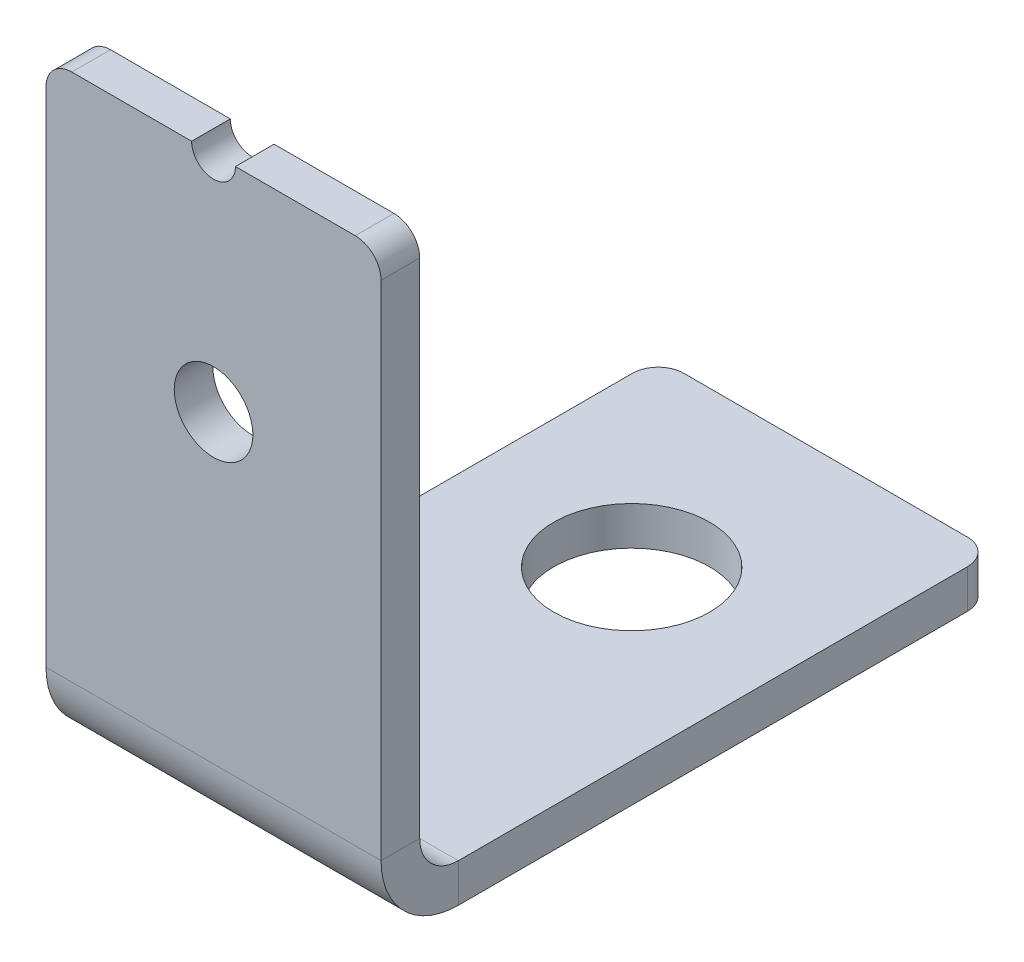
ISO-10303-21;
HEADER;
FILE_DESCRIPTION(('STEP AP214'),'2;1');
FILE_NAME('part.step','',(''),(''),'','','');
FILE_SCHEMA(('AUTOMOTIVE_DESIGN { 1 0 10303 214 1 1 1 1 }'));
ENDSEC;
DATA;
#1=APPLICATION_CONTEXT('core data for automotive mechanical design processes');
#2=APPLICATION_PROTOCOL_DEFINITION('international standard','automotive_design',2000,#1);
#3=PRODUCT_CONTEXT('',#1,'mechanical');
#4=PRODUCT('Part','Part','',(#3));
#5=PRODUCT_RELATED_PRODUCT_CATEGORY('part','',(#4));
#6=PRODUCT_DEFINITION_FORMATION('','',#4);
#7=PRODUCT_DEFINITION_CONTEXT('part definition',#1,'design');
#8=PRODUCT_DEFINITION('design','',#6,#7);
#9=PRODUCT_DEFINITION_SHAPE('','',#8);
#10=(LENGTH_UNIT() NAMED_UNIT(*) SI_UNIT(.MILLI.,.METRE.));
#11=(NAMED_UNIT(*) PLANE_ANGLE_UNIT() SI_UNIT($,.RADIAN.));
#12=(NAMED_UNIT(*) SI_UNIT($,.STERADIAN.) SOLID_ANGLE_UNIT());
#13=UNCERTAINTY_MEASURE_WITH_UNIT(LENGTH_MEASURE(1.E-05),#10,'distance_accuracy_value','');
#14=(GEOMETRIC_REPRESENTATION_CONTEXT(3) GLOBAL_UNCERTAINTY_ASSIGNED_CONTEXT((#13)) GLOBAL_UNIT_ASSIGNED_CONTEXT((#10,
#11,#12)) REPRESENTATION_CONTEXT('',''));
#15=CARTESIAN_POINT('',(0.,0.,0.));
#16=DIRECTION('',(0.,0.,1.));
#17=DIRECTION('',(1.,0.,0.));
#18=AXIS2_PLACEMENT_3D('',#15,#16,#17);
#19=CARTESIAN_POINT('',(0.,-3.,0.));
#20=DIRECTION('',(1.,0.,0.));
#21=DIRECTION('',(0.,0.,-1.));
#22=AXIS2_PLACEMENT_3D('',#19,#20,#21);
#23=PLANE('',#22);
#24=DIRECTION('',(0.,-1.,0.));
#25=VECTOR('',#24,1.);
#26=CARTESIAN_POINT('',(0.,-3.,-3.));
#27=LINE('',#26,#25);
#28=CARTESIAN_POINT('',(0.,0.,-3.));
#29=VERTEX_POINT('',#28);
#30=CARTESIAN_POINT('',(0.,-3.,-3.));
#31=VERTEX_POINT('',#30);
#32=EDGE_CURVE('E10',#29,#31,#27,.T.);
#33=ORIENTED_EDGE('',*,*,#32,.F.);
#34=DIRECTION('',(0.,0.,1.));
#35=VECTOR('',#34,1.);
#36=CARTESIAN_POINT('',(0.,0.,0.));
#37=LINE('',#36,#35);
#38=CARTESIAN_POINT('',(0.,0.,-42.5));
#39=VERTEX_POINT('',#38);
#40=EDGE_CURVE('E83',#29,#39,#37,.F.);
#41=ORIENTED_EDGE('',*,*,#40,.T.);
#42=DIRECTION('',(0.,-1.,0.));
#43=VECTOR('',#42,1.);
#44=CARTESIAN_POINT('',(0.,-3.,-42.5));
#45=LINE('',#44,#43);
#46=CARTESIAN_POINT('',(0.,-3.,-42.5));
#47=VERTEX_POINT('',#46);
#48=EDGE_CURVE('E26',#39,#47,#45,.T.);
#49=ORIENTED_EDGE('',*,*,#48,.T.);
#50=DIRECTION('',(0.,0.,-1.));
#51=VECTOR('',#50,1.);
#52=CARTESIAN_POINT('',(0.,-3.,0.));
#53=LINE('',#52,#51);
#54=EDGE_CURVE('E86',#31,#47,#53,.T.);
#55=ORIENTED_EDGE('',*,*,#54,.F.);
#56=EDGE_LOOP('',(#33,#41,#49,#55));
#57=FACE_BOUND('',#56,.T.);
#58=ADVANCED_FACE('F16',(#57),#23,.F.);
#59=CARTESIAN_POINT('',(2.,-3.,-42.5));
#60=DIRECTION('',(0.,1.,0.));
#61=DIRECTION('',(0.,0.,1.));
#62=AXIS2_PLACEMENT_3D('',#59,#60,#61);
#63=CYLINDRICAL_SURFACE('',#62,2.);
#64=ORIENTED_EDGE('',*,*,#48,.F.);
#65=CARTESIAN_POINT('',(2.,0.,-42.5));
#66=DIRECTION('',(0.,1.,0.));
#67=DIRECTION('',(0.,0.,1.));
#68=AXIS2_PLACEMENT_3D('',#65,#66,#67);
#69=CIRCLE('',#68,2.);
#70=CARTESIAN_POINT('',(2.00000000000001,0.,-44.5));
#71=VERTEX_POINT('',#70);
#72=EDGE_CURVE('E111',#39,#71,#69,.F.);
#73=ORIENTED_EDGE('',*,*,#72,.T.);
#74=DIRECTION('',(0.,-1.,0.));
#75=VECTOR('',#74,1.);
#76=CARTESIAN_POINT('',(2.00000000000001,-3.,-44.5));
#77=LINE('',#76,#75);
#78=CARTESIAN_POINT('',(2.00000000000001,-3.,-44.5));
#79=VERTEX_POINT('',#78);
#80=EDGE_CURVE('E151',#71,#79,#77,.T.);
#81=ORIENTED_EDGE('',*,*,#80,.T.);
#82=CARTESIAN_POINT('',(2.,-3.,-42.5));
#83=DIRECTION('',(0.,1.,0.));
#84=DIRECTION('',(0.,0.,1.));
#85=AXIS2_PLACEMENT_3D('',#82,#83,#84);
#86=CIRCLE('',#85,2.);
#87=EDGE_CURVE('E164',#47,#79,#86,.F.);
#88=ORIENTED_EDGE('',*,*,#87,.F.);
#89=EDGE_LOOP('',(#64,#73,#81,#88));
#90=FACE_BOUND('',#89,.T.);
#91=ADVANCED_FACE('F170',(#90),#63,.T.);
#92=CARTESIAN_POINT('',(26.,-3.,-44.5));
#93=DIRECTION('',(0.,0.,-1.));
#94=DIRECTION('',(-1.,0.,0.));
#95=AXIS2_PLACEMENT_3D('',#92,#93,#94);
#96=PLANE('',#95);
#97=ORIENTED_EDGE('',*,*,#80,.F.);
#98=DIRECTION('',(1.,0.,0.));
#99=VECTOR('',#98,1.);
#100=CARTESIAN_POINT('',(26.,0.,-44.5));
#101=LINE('',#100,#99);
#102=CARTESIAN_POINT('',(24.,0.,-44.5));
#103=VERTEX_POINT('',#102);
#104=EDGE_CURVE('E241',#103,#71,#101,.F.);
#105=ORIENTED_EDGE('',*,*,#104,.F.);
#106=DIRECTION('',(0.,-1.,0.));
#107=VECTOR('',#106,1.);
#108=CARTESIAN_POINT('',(24.,-3.,-44.5));
#109=LINE('',#108,#107);
#110=CARTESIAN_POINT('',(24.,-3.,-44.5));
#111=VERTEX_POINT('',#110);
#112=EDGE_CURVE('E148',#103,#111,#109,.T.);
#113=ORIENTED_EDGE('',*,*,#112,.T.);
#114=DIRECTION('',(-1.,0.,0.));
#115=VECTOR('',#114,1.);
#116=CARTESIAN_POINT('',(26.,-3.,-44.5));
#117=LINE('',#116,#115);
#118=EDGE_CURVE('E171',#111,#79,#117,.T.);
#119=ORIENTED_EDGE('',*,*,#118,.T.);
#120=EDGE_LOOP('',(#97,#105,#113,#119));
#121=FACE_BOUND('',#120,.T.);
#122=ADVANCED_FACE('F245',(#121),#96,.T.);
#123=CARTESIAN_POINT('',(24.,-3.,-42.5));
#124=DIRECTION('',(0.,1.,0.));
#125=DIRECTION('',(0.,0.,1.));
#126=AXIS2_PLACEMENT_3D('',#123,#124,#125);
#127=CYLINDRICAL_SURFACE('',#126,2.);
#128=ORIENTED_EDGE('',*,*,#112,.F.);
#129=CARTESIAN_POINT('',(24.,0.,-42.5));
#130=DIRECTION('',(0.,1.,0.));
#131=DIRECTION('',(0.,0.,1.));
#132=AXIS2_PLACEMENT_3D('',#129,#130,#131);
#133=CIRCLE('',#132,2.);
#134=CARTESIAN_POINT('',(26.,0.,-42.5));
#135=VERTEX_POINT('',#134);
#136=EDGE_CURVE('E238',#103,#135,#133,.F.);
#137=ORIENTED_EDGE('',*,*,#136,.T.);
#138=DIRECTION('',(0.,-1.,0.));
#139=VECTOR('',#138,1.);
#140=CARTESIAN_POINT('',(26.,-3.,-42.5));
#141=LINE('',#140,#139);
#142=CARTESIAN_POINT('',(26.,-3.,-42.5));
#143=VERTEX_POINT('',#142);
#144=EDGE_CURVE('E145',#135,#143,#141,.T.);
#145=ORIENTED_EDGE('',*,*,#144,.T.);
#146=CARTESIAN_POINT('',(24.,-3.,-42.5));
#147=DIRECTION('',(0.,1.,0.));
#148=DIRECTION('',(0.,0.,1.));
#149=AXIS2_PLACEMENT_3D('',#146,#147,#148);
#150=CIRCLE('',#149,2.);
#151=EDGE_CURVE('E173',#111,#143,#150,.F.);
#152=ORIENTED_EDGE('',*,*,#151,.F.);
#153=EDGE_LOOP('',(#128,#137,#145,#152));
#154=FACE_BOUND('',#153,.T.);
#155=ADVANCED_FACE('F252',(#154),#127,.T.);
#156=CARTESIAN_POINT('',(26.,-3.,0.));
#157=DIRECTION('',(1.,0.,0.));
#158=DIRECTION('',(0.,0.,-1.));
#159=AXIS2_PLACEMENT_3D('',#156,#157,#158);
#160=PLANE('',#159);
#161=ORIENTED_EDGE('',*,*,#144,.F.);
#162=DIRECTION('',(0.,0.,1.));
#163=VECTOR('',#162,1.);
#164=CARTESIAN_POINT('',(26.,0.,0.));
#165=LINE('',#164,#163);
#166=CARTESIAN_POINT('',(26.,0.,-3.));
#167=VERTEX_POINT('',#166);
#168=EDGE_CURVE('E218',#167,#135,#165,.F.);
#169=ORIENTED_EDGE('',*,*,#168,.F.);
#170=DIRECTION('',(0.,-1.,0.));
#171=VECTOR('',#170,1.);
#172=CARTESIAN_POINT('',(26.,-3.,-3.));
#173=LINE('',#172,#171);
#174=CARTESIAN_POINT('',(26.,-3.,-3.));
#175=VERTEX_POINT('',#174);
#176=EDGE_CURVE('E142',#167,#175,#173,.T.);
#177=ORIENTED_EDGE('',*,*,#176,.T.);
#178=DIRECTION('',(0.,0.,-1.));
#179=VECTOR('',#178,1.);
#180=CARTESIAN_POINT('',(26.,-3.,0.));
#181=LINE('',#180,#179);
#182=EDGE_CURVE('E179',#175,#143,#181,.T.);
#183=ORIENTED_EDGE('',*,*,#182,.T.);
#184=EDGE_LOOP('',(#161,#169,#177,#183));
#185=FACE_BOUND('',#184,.T.);
#186=ADVANCED_FACE('F256',(#185),#160,.T.);
#187=CARTESIAN_POINT('',(26.,3.,-3.));
#188=DIRECTION('',(1.,0.,0.));
#189=DIRECTION('',(0.,0.,-1.));
#190=AXIS2_PLACEMENT_3D('',#187,#188,#189);
#191=PLANE('',#190);
#192=ORIENTED_EDGE('',*,*,#176,.F.);
#193=CARTESIAN_POINT('',(26.,3.,-3.));
#194=DIRECTION('',(-1.,0.,0.));
#195=DIRECTION('',(0.,0.,1.));
#196=AXIS2_PLACEMENT_3D('',#193,#194,#195);
#197=CIRCLE('',#196,3.);
#198=CARTESIAN_POINT('',(26.,3.,0.));
#199=VERTEX_POINT('',#198);
#200=EDGE_CURVE('E100',#167,#199,#197,.T.);
#201=ORIENTED_EDGE('',*,*,#200,.T.);
#202=DIRECTION('',(0.,0.,1.));
#203=VECTOR('',#202,1.);
#204=CARTESIAN_POINT('',(26.,3.,3.));
#205=LINE('',#204,#203);
#206=CARTESIAN_POINT('',(26.,3.,3.));
#207=VERTEX_POINT('',#206);
#208=EDGE_CURVE('E140',#199,#207,#205,.T.);
#209=ORIENTED_EDGE('',*,*,#208,.T.);
#210=CARTESIAN_POINT('',(26.,3.,-3.));
#211=DIRECTION('',(-1.,0.,0.));
#212=DIRECTION('',(0.,0.,1.));
#213=AXIS2_PLACEMENT_3D('',#210,#211,#212);
#214=CIRCLE('',#213,6.);
#215=EDGE_CURVE('E210',#175,#207,#214,.T.);
#216=ORIENTED_EDGE('',*,*,#215,.F.);
#217=EDGE_LOOP('',(#192,#201,#209,#216));
#218=FACE_BOUND('',#217,.T.);
#219=ADVANCED_FACE('F259',(#218),#191,.T.);
#220=CARTESIAN_POINT('',(26.,0.,3.));
#221=DIRECTION('',(-1.,0.,0.));
#222=DIRECTION('',(0.,1.,0.));
#223=AXIS2_PLACEMENT_3D('',#220,#221,#222);
#224=PLANE('',#223);
#225=ORIENTED_EDGE('',*,*,#208,.F.);
#226=DIRECTION('',(0.,1.,0.));
#227=VECTOR('',#226,1.);
#228=CARTESIAN_POINT('',(26.,0.,0.));
#229=LINE('',#228,#227);
#230=CARTESIAN_POINT('',(26.,42.,0.));
#231=VERTEX_POINT('',#230);
#232=EDGE_CURVE('E217',#231,#199,#229,.F.);
#233=ORIENTED_EDGE('',*,*,#232,.F.);
#234=DIRECTION('',(0.,0.,1.));
#235=VECTOR('',#234,1.);
#236=CARTESIAN_POINT('',(26.,42.,3.));
#237=LINE('',#236,#235);
#238=CARTESIAN_POINT('',(26.,42.,3.));
#239=VERTEX_POINT('',#238);
#240=EDGE_CURVE('E137',#231,#239,#237,.T.);
#241=ORIENTED_EDGE('',*,*,#240,.T.);
#242=DIRECTION('',(0.,1.,0.));
#243=VECTOR('',#242,1.);
#244=CARTESIAN_POINT('',(26.,0.,3.));
#245=LINE('',#244,#243);
#246=EDGE_CURVE('E185',#239,#207,#245,.F.);
#247=ORIENTED_EDGE('',*,*,#246,.T.);
#248=EDGE_LOOP('',(#225,#233,#241,#247));
#249=FACE_BOUND('',#248,.T.);
#250=ADVANCED_FACE('F284',(#249),#224,.F.);
#251=CARTESIAN_POINT('',(24.,42.,3.));
#252=DIRECTION('',(0.,0.,-1.));
#253=DIRECTION('',(-1.,0.,0.));
#254=AXIS2_PLACEMENT_3D('',#251,#252,#253);
#255=CYLINDRICAL_SURFACE('',#254,2.);
#256=ORIENTED_EDGE('',*,*,#240,.F.);
#257=CARTESIAN_POINT('',(24.,42.,0.));
#258=DIRECTION('',(0.,0.,-1.));
#259=DIRECTION('',(-1.,0.,0.));
#260=AXIS2_PLACEMENT_3D('',#257,#258,#259);
#261=CIRCLE('',#260,2.);
#262=CARTESIAN_POINT('',(24.,44.,0.));
#263=VERTEX_POINT('',#262);
#264=EDGE_CURVE('E232',#231,#263,#261,.F.);
#265=ORIENTED_EDGE('',*,*,#264,.T.);
#266=DIRECTION('',(0.,0.,1.));
#267=VECTOR('',#266,1.);
#268=CARTESIAN_POINT('',(24.,44.,3.));
#269=LINE('',#268,#267);
#270=CARTESIAN_POINT('',(24.,44.,3.));
#271=VERTEX_POINT('',#270);
#272=EDGE_CURVE('E134',#263,#271,#269,.T.);
#273=ORIENTED_EDGE('',*,*,#272,.T.);
#274=CARTESIAN_POINT('',(24.,42.,3.));
#275=DIRECTION('',(0.,0.,-1.));
#276=DIRECTION('',(-1.,0.,0.));
#277=AXIS2_PLACEMENT_3D('',#274,#275,#276);
#278=CIRCLE('',#277,2.);
#279=EDGE_CURVE('E188',#239,#271,#278,.F.);
#280=ORIENTED_EDGE('',*,*,#279,.F.);
#281=EDGE_LOOP('',(#256,#265,#273,#280));
#282=FACE_BOUND('',#281,.T.);
#283=ADVANCED_FACE('F289',(#282),#255,.T.);
#284=CARTESIAN_POINT('',(26.,44.,3.));
#285=DIRECTION('',(0.,-1.,0.));
#286=DIRECTION('',(-1.,0.,0.));
#287=AXIS2_PLACEMENT_3D('',#284,#285,#286);
#288=PLANE('',#287);
#289=ORIENTED_EDGE('',*,*,#272,.F.);
#290=DIRECTION('',(-1.,0.,0.));
#291=VECTOR('',#290,1.);
#292=CARTESIAN_POINT('',(26.,44.,0.));
#293=LINE('',#292,#291);
#294=CARTESIAN_POINT('',(14.7,44.,0.));
#295=VERTEX_POINT('',#294);
#296=EDGE_CURVE('E229',#263,#295,#293,.T.);
#297=ORIENTED_EDGE('',*,*,#296,.T.);
#298=DIRECTION('',(0.,0.,1.));
#299=VECTOR('',#298,1.);
#300=CARTESIAN_POINT('',(14.7,44.,3.));
#301=LINE('',#300,#299);
#302=CARTESIAN_POINT('',(14.7,44.,3.));
#303=VERTEX_POINT('',#302);
#304=EDGE_CURVE('E131',#295,#303,#301,.T.);
#305=ORIENTED_EDGE('',*,*,#304,.T.);
#306=DIRECTION('',(-1.,0.,0.));
#307=VECTOR('',#306,1.);
#308=CARTESIAN_POINT('',(26.,44.,3.));
#309=LINE('',#308,#307);
#310=EDGE_CURVE('E191',#271,#303,#309,.T.);
#311=ORIENTED_EDGE('',*,*,#310,.F.);
#312=EDGE_LOOP('',(#289,#297,#305,#311));
#313=FACE_BOUND('',#312,.T.);
#314=ADVANCED_FACE('F292',(#313),#288,.F.);
#315=CARTESIAN_POINT('',(13.,44.,3.));
#316=DIRECTION('',(0.,0.,-1.));
#317=DIRECTION('',(-1.,0.,0.));
#318=AXIS2_PLACEMENT_3D('',#315,#316,#317);
#319=CYLINDRICAL_SURFACE('',#318,1.7);
#320=ORIENTED_EDGE('',*,*,#304,.F.);
#321=CARTESIAN_POINT('',(13.,44.,0.));
#322=DIRECTION('',(0.,0.,-1.));
#323=DIRECTION('',(-1.,0.,0.));
#324=AXIS2_PLACEMENT_3D('',#321,#322,#323);
#325=CIRCLE('',#324,1.7);
#326=CARTESIAN_POINT('',(11.3,44.,0.));
#327=VERTEX_POINT('',#326);
#328=EDGE_CURVE('E226',#295,#327,#325,.T.);
#329=ORIENTED_EDGE('',*,*,#328,.T.);
#330=DIRECTION('',(0.,0.,1.));
#331=VECTOR('',#330,1.);
#332=CARTESIAN_POINT('',(11.3,44.,3.));
#333=LINE('',#332,#331);
#334=CARTESIAN_POINT('',(11.3,44.,3.));
#335=VERTEX_POINT('',#334);
#336=EDGE_CURVE('E128',#327,#335,#333,.T.);
#337=ORIENTED_EDGE('',*,*,#336,.T.);
#338=CARTESIAN_POINT('',(13.,44.,3.));
#339=DIRECTION('',(0.,0.,-1.));
#340=DIRECTION('',(-1.,0.,0.));
#341=AXIS2_PLACEMENT_3D('',#338,#339,#340);
#342=CIRCLE('',#341,1.7);
#343=EDGE_CURVE('E194',#303,#335,#342,.T.);
#344=ORIENTED_EDGE('',*,*,#343,.F.);
#345=EDGE_LOOP('',(#320,#329,#337,#344));
#346=FACE_BOUND('',#345,.T.);
#347=ADVANCED_FACE('F300',(#346),#319,.F.);
#348=ORIENTED_EDGE('',*,*,#336,.F.);
#349=DIRECTION('',(-1.,0.,0.));
#350=VECTOR('',#349,1.);
#351=CARTESIAN_POINT('',(26.,44.,0.));
#352=LINE('',#351,#350);
#353=CARTESIAN_POINT('',(2.00000000000001,44.,0.));
#354=VERTEX_POINT('',#353);
#355=EDGE_CURVE('E223',#327,#354,#352,.T.);
#356=ORIENTED_EDGE('',*,*,#355,.T.);
#357=DIRECTION('',(0.,0.,1.));
#358=VECTOR('',#357,1.);
#359=CARTESIAN_POINT('',(2.00000000000001,44.,3.));
#360=LINE('',#359,#358);
#361=CARTESIAN_POINT('',(2.00000000000001,44.,3.));
#362=VERTEX_POINT('',#361);
#363=EDGE_CURVE('E125',#354,#362,#360,.T.);
#364=ORIENTED_EDGE('',*,*,#363,.T.);
#365=EDGE_CURVE('E195',#335,#362,#309,.T.);
#366=ORIENTED_EDGE('',*,*,#365,.F.);
#367=EDGE_LOOP('',(#348,#356,#364,#366));
#368=FACE_BOUND('',#367,.T.);
#369=ADVANCED_FACE('F304',(#368),#288,.F.);
#370=CARTESIAN_POINT('',(2.,42.,3.));
#371=DIRECTION('',(0.,0.,-1.));
#372=DIRECTION('',(-1.,0.,0.));
#373=AXIS2_PLACEMENT_3D('',#370,#371,#372);
#374=CYLINDRICAL_SURFACE('',#373,2.);
#375=ORIENTED_EDGE('',*,*,#363,.F.);
#376=CARTESIAN_POINT('',(2.,42.,0.));
#377=DIRECTION('',(0.,0.,-1.));
#378=DIRECTION('',(-1.,0.,0.));
#379=AXIS2_PLACEMENT_3D('',#376,#377,#378);
#380=CIRCLE('',#379,2.);
#381=CARTESIAN_POINT('',(0.,42.,0.));
#382=VERTEX_POINT('',#381);
#383=EDGE_CURVE('E220',#354,#382,#380,.F.);
#384=ORIENTED_EDGE('',*,*,#383,.T.);
#385=DIRECTION('',(0.,0.,1.));
#386=VECTOR('',#385,1.);
#387=CARTESIAN_POINT('',(0.,42.,3.));
#388=LINE('',#387,#386);
#389=CARTESIAN_POINT('',(0.,42.,3.));
#390=VERTEX_POINT('',#389);
#391=EDGE_CURVE('E122',#382,#390,#388,.T.);
#392=ORIENTED_EDGE('',*,*,#391,.T.);
#393=CARTESIAN_POINT('',(2.,42.,3.));
#394=DIRECTION('',(0.,0.,-1.));
#395=DIRECTION('',(-1.,0.,0.));
#396=AXIS2_PLACEMENT_3D('',#393,#394,#395);
#397=CIRCLE('',#396,2.);
#398=EDGE_CURVE('E198',#362,#390,#397,.F.);
#399=ORIENTED_EDGE('',*,*,#398,.F.);
#400=EDGE_LOOP('',(#375,#384,#392,#399));
#401=FACE_BOUND('',#400,.T.);
#402=ADVANCED_FACE('F305',(#401),#374,.T.);
#403=CARTESIAN_POINT('',(0.,0.,3.));
#404=DIRECTION('',(-1.,0.,0.));
#405=DIRECTION('',(0.,1.,0.));
#406=AXIS2_PLACEMENT_3D('',#403,#404,#405);
#407=PLANE('',#406);
#408=ORIENTED_EDGE('',*,*,#391,.F.);
#409=DIRECTION('',(0.,1.,0.));
#410=VECTOR('',#409,1.);
#411=CARTESIAN_POINT('',(0.,0.,0.));
#412=LINE('',#411,#410);
#413=CARTESIAN_POINT('',(0.,3.,0.));
#414=VERTEX_POINT('',#413);
#415=EDGE_CURVE('E105',#382,#414,#412,.F.);
#416=ORIENTED_EDGE('',*,*,#415,.T.);
#417=DIRECTION('',(0.,0.,1.));
#418=VECTOR('',#417,1.);
#419=CARTESIAN_POINT('',(0.,3.,3.));
#420=LINE('',#419,#418);
#421=CARTESIAN_POINT('',(0.,3.,3.));
#422=VERTEX_POINT('',#421);
#423=EDGE_CURVE('E20',#414,#422,#420,.T.);
#424=ORIENTED_EDGE('',*,*,#423,.T.);
#425=DIRECTION('',(0.,1.,0.));
#426=VECTOR('',#425,1.);
#427=CARTESIAN_POINT('',(0.,0.,3.));
#428=LINE('',#427,#426);
#429=EDGE_CURVE('E201',#390,#422,#428,.F.);
#430=ORIENTED_EDGE('',*,*,#429,.F.);
#431=EDGE_LOOP('',(#408,#416,#424,#430));
#432=FACE_BOUND('',#431,.T.);
#433=ADVANCED_FACE('F270',(#432),#407,.T.);
#434=CARTESIAN_POINT('',(13.,-3.,-29.45));
#435=DIRECTION('',(0.,1.,0.));
#436=DIRECTION('',(0.,0.,1.));
#437=AXIS2_PLACEMENT_3D('',#434,#435,#436);
#438=CYLINDRICAL_SURFACE('',#437,6.05);
#439=CARTESIAN_POINT('',(13.,-3.,-29.45));
#440=DIRECTION('',(0.,1.,0.));
#441=DIRECTION('',(0.,0.,1.));
#442=AXIS2_PLACEMENT_3D('',#439,#440,#441);
#443=CIRCLE('',#442,6.05);
#444=CARTESIAN_POINT('',(13.,-3.,-23.4));
#445=VERTEX_POINT('',#444);
#446=EDGE_CURVE('E168',#445,#445,#443,.T.);
#447=ORIENTED_EDGE('',*,*,#446,.F.);
#448=EDGE_LOOP('',(#447));
#449=FACE_BOUND('',#448,.T.);
#450=CARTESIAN_POINT('',(13.,0.,-29.45));
#451=DIRECTION('',(0.,1.,0.));
#452=DIRECTION('',(0.,0.,1.));
#453=AXIS2_PLACEMENT_3D('',#450,#451,#452);
#454=CIRCLE('',#453,6.05);
#455=CARTESIAN_POINT('',(13.,0.,-23.4));
#456=VERTEX_POINT('',#455);
#457=EDGE_CURVE('E112',#456,#456,#454,.T.);
#458=ORIENTED_EDGE('',*,*,#457,.T.);
#459=EDGE_LOOP('',(#458));
#460=FACE_BOUND('',#459,.T.);
#461=ADVANCED_FACE('F18',(#449,#460),#438,.F.);
#462=CARTESIAN_POINT('',(13.,26.65,3.));
#463=DIRECTION('',(0.,0.,-1.));
#464=DIRECTION('',(-1.,0.,0.));
#465=AXIS2_PLACEMENT_3D('',#462,#463,#464);
#466=CYLINDRICAL_SURFACE('',#465,3.05);
#467=CARTESIAN_POINT('',(13.,26.65,3.));
#468=DIRECTION('',(0.,0.,-1.));
#469=DIRECTION('',(-1.,0.,0.));
#470=AXIS2_PLACEMENT_3D('',#467,#468,#469);
#471=CIRCLE('',#470,3.05);
#472=CARTESIAN_POINT('',(9.95,26.65,3.));
#473=VERTEX_POINT('',#472);
#474=EDGE_CURVE('E182',#473,#473,#471,.T.);
#475=ORIENTED_EDGE('',*,*,#474,.F.);
#476=EDGE_LOOP('',(#475));
#477=FACE_BOUND('',#476,.T.);
#478=CARTESIAN_POINT('',(13.,26.65,0.));
#479=DIRECTION('',(0.,0.,-1.));
#480=DIRECTION('',(-1.,0.,0.));
#481=AXIS2_PLACEMENT_3D('',#478,#479,#480);
#482=CIRCLE('',#481,3.05);
#483=CARTESIAN_POINT('',(9.95,26.65,0.));
#484=VERTEX_POINT('',#483);
#485=EDGE_CURVE('E214',#484,#484,#482,.T.);
#486=ORIENTED_EDGE('',*,*,#485,.T.);
#487=EDGE_LOOP('',(#486));
#488=FACE_BOUND('',#487,.T.);
#489=ADVANCED_FACE('F323',(#477,#488),#466,.F.);
#490=CARTESIAN_POINT('',(0.,3.,-3.));
#491=DIRECTION('',(-1.,0.,0.));
#492=DIRECTION('',(0.,0.,1.));
#493=AXIS2_PLACEMENT_3D('',#490,#491,#492);
#494=PLANE('',#493);
#495=CARTESIAN_POINT('',(0.,3.,-3.));
#496=DIRECTION('',(-1.,0.,0.));
#497=DIRECTION('',(0.,0.,1.));
#498=AXIS2_PLACEMENT_3D('',#495,#496,#497);
#499=CIRCLE('',#498,3.);
#500=EDGE_CURVE('E98',#414,#29,#499,.F.);
#501=ORIENTED_EDGE('',*,*,#500,.T.);
#502=ORIENTED_EDGE('',*,*,#32,.T.);
#503=CARTESIAN_POINT('',(0.,3.,-3.));
#504=DIRECTION('',(1.,0.,0.));
#505=DIRECTION('',(0.,0.,-1.));
#506=AXIS2_PLACEMENT_3D('',#503,#504,#505);
#507=CIRCLE('',#506,6.);
#508=EDGE_CURVE('E208',#422,#31,#507,.T.);
#509=ORIENTED_EDGE('',*,*,#508,.F.);
#510=ORIENTED_EDGE('',*,*,#423,.F.);
#511=EDGE_LOOP('',(#501,#502,#509,#510));
#512=FACE_BOUND('',#511,.T.);
#513=ADVANCED_FACE('F114',(#512),#494,.T.);
#514=CARTESIAN_POINT('',(26.,0.,3.));
#515=DIRECTION('',(0.,0.,-1.));
#516=DIRECTION('',(-1.,0.,0.));
#517=AXIS2_PLACEMENT_3D('',#514,#515,#516);
#518=PLANE('',#517);
#519=ORIENTED_EDGE('',*,*,#474,.T.);
#520=EDGE_LOOP('',(#519));
#521=FACE_BOUND('',#520,.T.);
#522=ORIENTED_EDGE('',*,*,#429,.T.);
#523=DIRECTION('',(-1.,0.,0.));
#524=VECTOR('',#523,1.);
#525=CARTESIAN_POINT('',(26.,3.,3.));
#526=LINE('',#525,#524);
#527=EDGE_CURVE('E205',#422,#207,#526,.F.);
#528=ORIENTED_EDGE('',*,*,#527,.T.);
#529=ORIENTED_EDGE('',*,*,#246,.F.);
#530=ORIENTED_EDGE('',*,*,#279,.T.);
#531=ORIENTED_EDGE('',*,*,#310,.T.);
#532=ORIENTED_EDGE('',*,*,#343,.T.);
#533=ORIENTED_EDGE('',*,*,#365,.T.);
#534=ORIENTED_EDGE('',*,*,#398,.T.);
#535=EDGE_LOOP('',(#522,#528,#529,#530,#531,#532,#533,#534));
#536=FACE_BOUND('',#535,.T.);
#537=ADVANCED_FACE('F266',(#521,#536),#518,.F.);
#538=CARTESIAN_POINT('',(26.,-3.,0.));
#539=DIRECTION('',(0.,1.,0.));
#540=DIRECTION('',(0.,0.,1.));
#541=AXIS2_PLACEMENT_3D('',#538,#539,#540);
#542=PLANE('',#541);
#543=ORIENTED_EDGE('',*,*,#446,.T.);
#544=EDGE_LOOP('',(#543));
#545=FACE_BOUND('',#544,.T.);
#546=ORIENTED_EDGE('',*,*,#182,.F.);
#547=DIRECTION('',(-1.,0.,0.));
#548=VECTOR('',#547,1.);
#549=CARTESIAN_POINT('',(26.,-3.,-3.));
#550=LINE('',#549,#548);
#551=EDGE_CURVE('E167',#175,#31,#550,.T.);
#552=ORIENTED_EDGE('',*,*,#551,.T.);
#553=ORIENTED_EDGE('',*,*,#54,.T.);
#554=ORIENTED_EDGE('',*,*,#87,.T.);
#555=ORIENTED_EDGE('',*,*,#118,.F.);
#556=ORIENTED_EDGE('',*,*,#151,.T.);
#557=EDGE_LOOP('',(#546,#552,#553,#554,#555,#556));
#558=FACE_BOUND('',#557,.T.);
#559=ADVANCED_FACE('F162',(#545,#558),#542,.F.);
#560=CARTESIAN_POINT('',(26.,3.,-3.));
#561=DIRECTION('',(-1.,0.,0.));
#562=DIRECTION('',(0.,0.,1.));
#563=AXIS2_PLACEMENT_3D('',#560,#561,#562);
#564=CYLINDRICAL_SURFACE('',#563,6.);
#565=ORIENTED_EDGE('',*,*,#215,.T.);
#566=ORIENTED_EDGE('',*,*,#527,.F.);
#567=ORIENTED_EDGE('',*,*,#508,.T.);
#568=ORIENTED_EDGE('',*,*,#551,.F.);
#569=EDGE_LOOP('',(#565,#566,#567,#568));
#570=FACE_BOUND('',#569,.T.);
#571=ADVANCED_FACE('F262',(#570),#564,.T.);
#572=CARTESIAN_POINT('',(26.,0.,0.));
#573=DIRECTION('',(0.,0.,-1.));
#574=DIRECTION('',(-1.,0.,0.));
#575=AXIS2_PLACEMENT_3D('',#572,#573,#574);
#576=PLANE('',#575);
#577=ORIENTED_EDGE('',*,*,#485,.F.);
#578=EDGE_LOOP('',(#577));
#579=FACE_BOUND('',#578,.T.);
#580=ORIENTED_EDGE('',*,*,#415,.F.);
#581=ORIENTED_EDGE('',*,*,#383,.F.);
#582=ORIENTED_EDGE('',*,*,#355,.F.);
#583=ORIENTED_EDGE('',*,*,#328,.F.);
#584=ORIENTED_EDGE('',*,*,#296,.F.);
#585=ORIENTED_EDGE('',*,*,#264,.F.);
#586=ORIENTED_EDGE('',*,*,#232,.T.);
#587=DIRECTION('',(-1.,0.,0.));
#588=VECTOR('',#587,1.);
#589=CARTESIAN_POINT('',(26.,3.,0.));
#590=LINE('',#589,#588);
#591=EDGE_CURVE('E104',#414,#199,#590,.F.);
#592=ORIENTED_EDGE('',*,*,#591,.F.);
#593=EDGE_LOOP('',(#580,#581,#582,#583,#584,#585,#586,#592));
#594=FACE_BOUND('',#593,.T.);
#595=ADVANCED_FACE('F296',(#579,#594),#576,.T.);
#596=CARTESIAN_POINT('',(26.,0.,0.));
#597=DIRECTION('',(0.,1.,0.));
#598=DIRECTION('',(0.,0.,1.));
#599=AXIS2_PLACEMENT_3D('',#596,#597,#598);
#600=PLANE('',#599);
#601=ORIENTED_EDGE('',*,*,#457,.F.);
#602=EDGE_LOOP('',(#601));
#603=FACE_BOUND('',#602,.T.);
#604=ORIENTED_EDGE('',*,*,#168,.T.);
#605=ORIENTED_EDGE('',*,*,#136,.F.);
#606=ORIENTED_EDGE('',*,*,#104,.T.);
#607=ORIENTED_EDGE('',*,*,#72,.F.);
#608=ORIENTED_EDGE('',*,*,#40,.F.);
#609=DIRECTION('',(1.,0.,0.));
#610=VECTOR('',#609,1.);
#611=CARTESIAN_POINT('',(26.,0.,-3.));
#612=LINE('',#611,#610);
#613=EDGE_CURVE('E95',#167,#29,#612,.F.);
#614=ORIENTED_EDGE('',*,*,#613,.F.);
#615=EDGE_LOOP('',(#604,#605,#606,#607,#608,#614));
#616=FACE_BOUND('',#615,.T.);
#617=ADVANCED_FACE('F108',(#603,#616),#600,.T.);
#618=CARTESIAN_POINT('',(26.,3.,-3.));
#619=DIRECTION('',(-1.,0.,0.));
#620=DIRECTION('',(0.,0.,1.));
#621=AXIS2_PLACEMENT_3D('',#618,#619,#620);
#622=CYLINDRICAL_SURFACE('',#621,3.);
#623=ORIENTED_EDGE('',*,*,#200,.F.);
#624=ORIENTED_EDGE('',*,*,#613,.T.);
#625=ORIENTED_EDGE('',*,*,#500,.F.);
#626=ORIENTED_EDGE('',*,*,#591,.T.);
#627=EDGE_LOOP('',(#623,#624,#625,#626));
#628=FACE_BOUND('',#627,.T.);
#629=ADVANCED_FACE('F96',(#628),#622,.F.);
#630=CLOSED_SHELL('',(#58,#91,#122,#155,#186,#219,#250,#283,#314,#347,#369,#402,#433,#461,#489,
#513,#537,#559,#571,#595,#617,#629));
#631=MANIFOLD_SOLID_BREP('B1',#630);
#632=ADVANCED_BREP_SHAPE_REPRESENTATION('',(#18,#631),#14);
#633=SHAPE_DEFINITION_REPRESENTATION(#9,#632);
ENDSEC;
END-ISO-10303-21;
